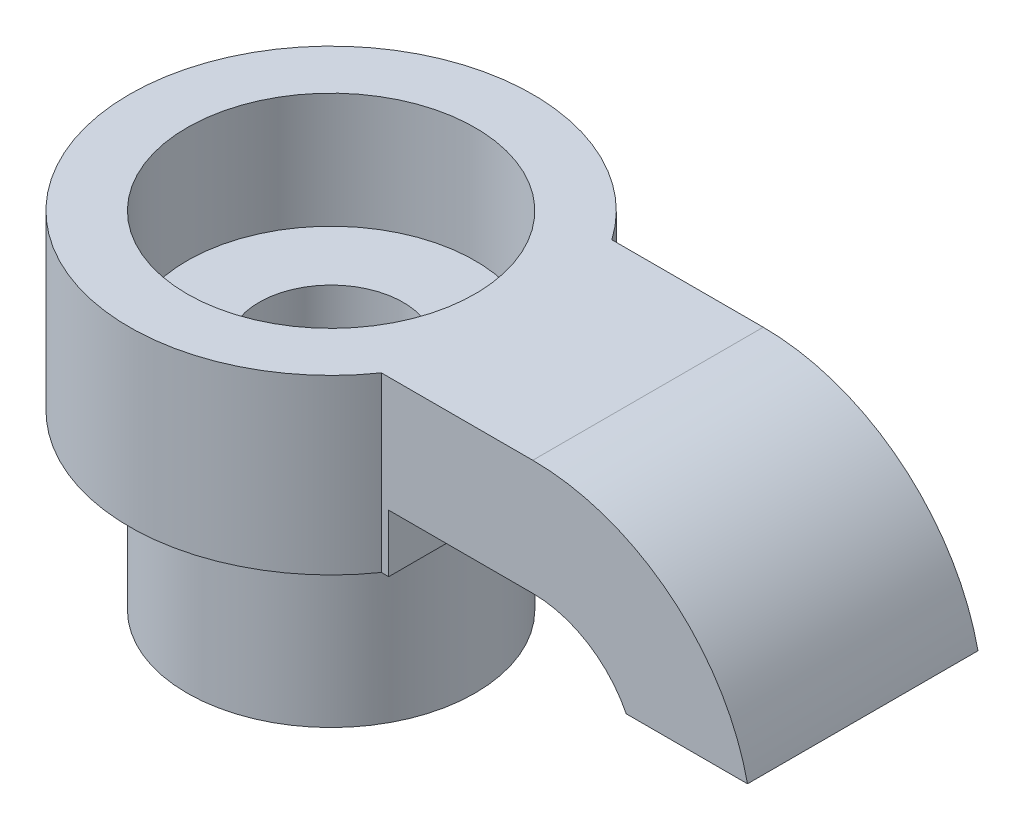
ISO-10303-21;
HEADER;
FILE_DESCRIPTION(('STEP AP214'),'2;1');
FILE_NAME('part.step','',(''),(''),'','','');
FILE_SCHEMA(('AUTOMOTIVE_DESIGN { 1 0 10303 214 1 1 1 1 }'));
ENDSEC;
DATA;
#1=APPLICATION_CONTEXT('core data for automotive mechanical design processes');
#2=APPLICATION_PROTOCOL_DEFINITION('international standard','automotive_design',2000,#1);
#3=PRODUCT_CONTEXT('',#1,'mechanical');
#4=PRODUCT('Part','Part','',(#3));
#5=PRODUCT_RELATED_PRODUCT_CATEGORY('part','',(#4));
#6=PRODUCT_DEFINITION_FORMATION('','',#4);
#7=PRODUCT_DEFINITION_CONTEXT('part definition',#1,'design');
#8=PRODUCT_DEFINITION('design','',#6,#7);
#9=PRODUCT_DEFINITION_SHAPE('','',#8);
#10=(LENGTH_UNIT() NAMED_UNIT(*) SI_UNIT(.MILLI.,.METRE.));
#11=(NAMED_UNIT(*) PLANE_ANGLE_UNIT() SI_UNIT($,.RADIAN.));
#12=(NAMED_UNIT(*) SI_UNIT($,.STERADIAN.) SOLID_ANGLE_UNIT());
#13=UNCERTAINTY_MEASURE_WITH_UNIT(LENGTH_MEASURE(1.E-05),#10,'distance_accuracy_value','');
#14=(GEOMETRIC_REPRESENTATION_CONTEXT(3) GLOBAL_UNCERTAINTY_ASSIGNED_CONTEXT((#13)) GLOBAL_UNIT_ASSIGNED_CONTEXT((#10,
#11,#12)) REPRESENTATION_CONTEXT('',''));
#15=CARTESIAN_POINT('',(0.,0.,0.));
#16=DIRECTION('',(0.,0.,1.));
#17=DIRECTION('',(1.,0.,0.));
#18=AXIS2_PLACEMENT_3D('',#15,#16,#17);
#19=CARTESIAN_POINT('',(-6.,-6.,4.));
#20=DIRECTION('',(0.,1.,0.));
#21=DIRECTION('',(0.,0.,1.));
#22=AXIS2_PLACEMENT_3D('',#19,#20,#21);
#23=PLANE('',#22);
#24=CARTESIAN_POINT('',(-6.,-6.,4.));
#25=DIRECTION('',(0.,1.,0.));
#26=DIRECTION('',(0.,0.,1.));
#27=AXIS2_PLACEMENT_3D('',#24,#25,#26);
#28=CIRCLE('',#27,7.);
#29=CARTESIAN_POINT('',(-0.255437353461972,-6.,0.));
#30=VERTEX_POINT('',#29);
#31=CARTESIAN_POINT('',(-0.255437353461972,-6.,8.));
#32=VERTEX_POINT('',#31);
#33=EDGE_CURVE('E129',#30,#32,#28,.T.);
#34=ORIENTED_EDGE('',*,*,#33,.F.);
#35=DIRECTION('',(-1.,0.,0.));
#36=VECTOR('',#35,1.);
#37=CARTESIAN_POINT('',(-0.255437353461972,-6.,0.));
#38=LINE('',#37,#36);
#39=CARTESIAN_POINT('',(0.,-6.,0.));
#40=VERTEX_POINT('',#39);
#41=EDGE_CURVE('E122',#40,#30,#38,.T.);
#42=ORIENTED_EDGE('',*,*,#41,.F.);
#43=DIRECTION('',(0.,0.,-1.));
#44=VECTOR('',#43,1.);
#45=CARTESIAN_POINT('',(0.,-6.,0.));
#46=LINE('',#45,#44);
#47=CARTESIAN_POINT('',(0.,-6.,8.));
#48=VERTEX_POINT('',#47);
#49=EDGE_CURVE('E132',#48,#40,#46,.T.);
#50=ORIENTED_EDGE('',*,*,#49,.F.);
#51=DIRECTION('',(1.,0.,0.));
#52=VECTOR('',#51,1.);
#53=CARTESIAN_POINT('',(0.,-6.,8.));
#54=LINE('',#53,#52);
#55=EDGE_CURVE('E114',#32,#48,#54,.T.);
#56=ORIENTED_EDGE('',*,*,#55,.F.);
#57=EDGE_LOOP('',(#34,#42,#50,#56));
#58=FACE_BOUND('',#57,.T.);
#59=CARTESIAN_POINT('',(-6.,-6.,4.));
#60=DIRECTION('',(0.,1.,0.));
#61=DIRECTION('',(0.,0.,1.));
#62=AXIS2_PLACEMENT_3D('',#59,#60,#61);
#63=CIRCLE('',#62,5.);
#64=CARTESIAN_POINT('',(-6.,-6.,9.));
#65=VERTEX_POINT('',#64);
#66=EDGE_CURVE('E11',#65,#65,#63,.F.);
#67=ORIENTED_EDGE('',*,*,#66,.F.);
#68=EDGE_LOOP('',(#67));
#69=FACE_BOUND('',#68,.T.);
#70=ADVANCED_FACE('F36',(#58,#69),#23,.F.);
#71=CARTESIAN_POINT('',(0.,-4.,8.));
#72=DIRECTION('',(0.,1.,0.));
#73=DIRECTION('',(0.,0.,1.));
#74=AXIS2_PLACEMENT_3D('',#71,#72,#73);
#75=PLANE('',#74);
#76=DIRECTION('',(1.,0.,0.));
#77=VECTOR('',#76,1.);
#78=CARTESIAN_POINT('',(0.,-4.,0.));
#79=LINE('',#78,#77);
#80=CARTESIAN_POINT('',(0.,-4.,0.));
#81=VERTEX_POINT('',#80);
#82=CARTESIAN_POINT('',(5.,-4.,0.));
#83=VERTEX_POINT('',#82);
#84=EDGE_CURVE('E147',#81,#83,#79,.T.);
#85=ORIENTED_EDGE('',*,*,#84,.T.);
#86=DIRECTION('',(0.,0.,-1.));
#87=VECTOR('',#86,1.);
#88=CARTESIAN_POINT('',(5.,-4.,8.));
#89=LINE('',#88,#87);
#90=CARTESIAN_POINT('',(5.,-4.,8.));
#91=VERTEX_POINT('',#90);
#92=EDGE_CURVE('E173',#91,#83,#89,.T.);
#93=ORIENTED_EDGE('',*,*,#92,.F.);
#94=DIRECTION('',(1.,0.,0.));
#95=VECTOR('',#94,1.);
#96=CARTESIAN_POINT('',(0.,-4.,8.));
#97=LINE('',#96,#95);
#98=CARTESIAN_POINT('',(0.,-4.,8.));
#99=VERTEX_POINT('',#98);
#100=EDGE_CURVE('E88',#99,#91,#97,.T.);
#101=ORIENTED_EDGE('',*,*,#100,.F.);
#102=DIRECTION('',(0.,0.,-1.));
#103=VECTOR('',#102,1.);
#104=CARTESIAN_POINT('',(0.,-4.,8.));
#105=LINE('',#104,#103);
#106=EDGE_CURVE('E46',#99,#81,#105,.T.);
#107=ORIENTED_EDGE('',*,*,#106,.T.);
#108=EDGE_LOOP('',(#85,#93,#101,#107));
#109=FACE_BOUND('',#108,.T.);
#110=ADVANCED_FACE('F38',(#109),#75,.F.);
#111=CARTESIAN_POINT('',(5.,-7.63014946104609,8.));
#112=DIRECTION('',(0.,0.,-1.));
#113=DIRECTION('',(-1.,0.,0.));
#114=AXIS2_PLACEMENT_3D('',#111,#112,#113);
#115=CYLINDRICAL_SURFACE('',#114,3.63014946104609);
#116=CARTESIAN_POINT('',(5.,-7.63014946104609,0.));
#117=DIRECTION('',(0.,0.,-1.));
#118=DIRECTION('',(-1.,0.,0.));
#119=AXIS2_PLACEMENT_3D('',#116,#117,#118);
#120=CIRCLE('',#119,3.63014946104609);
#121=CARTESIAN_POINT('',(8.24354710836522,-6.,0.));
#122=VERTEX_POINT('',#121);
#123=EDGE_CURVE('E162',#83,#122,#120,.T.);
#124=ORIENTED_EDGE('',*,*,#123,.T.);
#125=DIRECTION('',(0.,0.,-1.));
#126=VECTOR('',#125,1.);
#127=CARTESIAN_POINT('',(8.24354710836522,-6.,8.));
#128=LINE('',#127,#126);
#129=CARTESIAN_POINT('',(8.24354710836522,-6.,8.));
#130=VERTEX_POINT('',#129);
#131=EDGE_CURVE('E171',#130,#122,#128,.T.);
#132=ORIENTED_EDGE('',*,*,#131,.F.);
#133=CARTESIAN_POINT('',(5.,-7.63014946104609,8.));
#134=DIRECTION('',(0.,0.,-1.));
#135=DIRECTION('',(-1.,0.,0.));
#136=AXIS2_PLACEMENT_3D('',#133,#134,#135);
#137=CIRCLE('',#136,3.63014946104609);
#138=EDGE_CURVE('E155',#91,#130,#137,.T.);
#139=ORIENTED_EDGE('',*,*,#138,.F.);
#140=ORIENTED_EDGE('',*,*,#92,.T.);
#141=EDGE_LOOP('',(#124,#132,#139,#140));
#142=FACE_BOUND('',#141,.T.);
#143=ADVANCED_FACE('F194',(#142),#115,.F.);
#144=CARTESIAN_POINT('',(8.24354710836522,-6.,8.));
#145=DIRECTION('',(0.,1.,0.));
#146=DIRECTION('',(0.,0.,1.));
#147=AXIS2_PLACEMENT_3D('',#144,#145,#146);
#148=PLANE('',#147);
#149=DIRECTION('',(1.,0.,0.));
#150=VECTOR('',#149,1.);
#151=CARTESIAN_POINT('',(8.24354710836522,-6.,0.));
#152=LINE('',#151,#150);
#153=CARTESIAN_POINT('',(12.4539783694718,-6.,0.));
#154=VERTEX_POINT('',#153);
#155=EDGE_CURVE('E75',#122,#154,#152,.T.);
#156=ORIENTED_EDGE('',*,*,#155,.T.);
#157=DIRECTION('',(0.,0.,-1.));
#158=VECTOR('',#157,1.);
#159=CARTESIAN_POINT('',(12.4539783694718,-6.,8.));
#160=LINE('',#159,#158);
#161=CARTESIAN_POINT('',(12.4539783694718,-6.,8.));
#162=VERTEX_POINT('',#161);
#163=EDGE_CURVE('E169',#162,#154,#160,.T.);
#164=ORIENTED_EDGE('',*,*,#163,.F.);
#165=DIRECTION('',(1.,0.,0.));
#166=VECTOR('',#165,1.);
#167=CARTESIAN_POINT('',(8.24354710836522,-6.,8.));
#168=LINE('',#167,#166);
#169=EDGE_CURVE('E157',#130,#162,#168,.T.);
#170=ORIENTED_EDGE('',*,*,#169,.F.);
#171=ORIENTED_EDGE('',*,*,#131,.T.);
#172=EDGE_LOOP('',(#156,#164,#170,#171));
#173=FACE_BOUND('',#172,.T.);
#174=ADVANCED_FACE('F197',(#173),#148,.F.);
#175=CARTESIAN_POINT('',(5.,-7.63014946104609,8.));
#176=DIRECTION('',(0.,0.,-1.));
#177=DIRECTION('',(-1.,0.,0.));
#178=AXIS2_PLACEMENT_3D('',#175,#176,#177);
#179=CYLINDRICAL_SURFACE('',#178,7.63014946104609);
#180=CARTESIAN_POINT('',(5.,-7.63014946104609,0.));
#181=DIRECTION('',(0.,0.,1.));
#182=DIRECTION('',(-1.,0.,0.));
#183=AXIS2_PLACEMENT_3D('',#180,#181,#182);
#184=CIRCLE('',#183,7.63014946104609);
#185=CARTESIAN_POINT('',(5.,0.,0.));
#186=VERTEX_POINT('',#185);
#187=EDGE_CURVE('E81',#154,#186,#184,.T.);
#188=ORIENTED_EDGE('',*,*,#187,.T.);
#189=DIRECTION('',(0.,0.,-1.));
#190=VECTOR('',#189,1.);
#191=CARTESIAN_POINT('',(5.,0.,8.));
#192=LINE('',#191,#190);
#193=CARTESIAN_POINT('',(5.,0.,8.));
#194=VERTEX_POINT('',#193);
#195=EDGE_CURVE('E161',#194,#186,#192,.T.);
#196=ORIENTED_EDGE('',*,*,#195,.F.);
#197=CARTESIAN_POINT('',(5.,-7.63014946104609,8.));
#198=DIRECTION('',(0.,0.,1.));
#199=DIRECTION('',(-1.,0.,0.));
#200=AXIS2_PLACEMENT_3D('',#197,#198,#199);
#201=CIRCLE('',#200,7.63014946104609);
#202=EDGE_CURVE('E54',#162,#194,#201,.T.);
#203=ORIENTED_EDGE('',*,*,#202,.F.);
#204=ORIENTED_EDGE('',*,*,#163,.T.);
#205=EDGE_LOOP('',(#188,#196,#203,#204));
#206=FACE_BOUND('',#205,.T.);
#207=ADVANCED_FACE('F198',(#206),#179,.T.);
#208=CARTESIAN_POINT('',(0.,0.,8.));
#209=DIRECTION('',(0.,-1.,0.));
#210=DIRECTION('',(0.,0.,-1.));
#211=AXIS2_PLACEMENT_3D('',#208,#209,#210);
#212=PLANE('',#211);
#213=CARTESIAN_POINT('',(-6.,0.,4.));
#214=DIRECTION('',(0.,1.,0.));
#215=DIRECTION('',(0.,0.,1.));
#216=AXIS2_PLACEMENT_3D('',#213,#214,#215);
#217=CIRCLE('',#216,5.00000000000002);
#218=CARTESIAN_POINT('',(-6.,0.,9.00000000000001));
#219=VERTEX_POINT('',#218);
#220=EDGE_CURVE('E348',#219,#219,#217,.T.);
#221=ORIENTED_EDGE('',*,*,#220,.F.);
#222=EDGE_LOOP('',(#221));
#223=FACE_BOUND('',#222,.T.);
#224=DIRECTION('',(-1.,0.,0.));
#225=VECTOR('',#224,1.);
#226=CARTESIAN_POINT('',(0.,0.,0.));
#227=LINE('',#226,#225);
#228=CARTESIAN_POINT('',(-0.255437353461972,0.,0.));
#229=VERTEX_POINT('',#228);
#230=EDGE_CURVE('E166',#186,#229,#227,.T.);
#231=ORIENTED_EDGE('',*,*,#230,.T.);
#232=CARTESIAN_POINT('',(-6.,0.,4.));
#233=DIRECTION('',(0.,1.,0.));
#234=DIRECTION('',(0.,0.,1.));
#235=AXIS2_PLACEMENT_3D('',#232,#233,#234);
#236=CIRCLE('',#235,7.);
#237=CARTESIAN_POINT('',(-0.255437353461972,0.,8.));
#238=VERTEX_POINT('',#237);
#239=EDGE_CURVE('E137',#229,#238,#236,.T.);
#240=ORIENTED_EDGE('',*,*,#239,.T.);
#241=DIRECTION('',(-1.,0.,0.));
#242=VECTOR('',#241,1.);
#243=CARTESIAN_POINT('',(0.,0.,8.));
#244=LINE('',#243,#242);
#245=EDGE_CURVE('E116',#194,#238,#244,.T.);
#246=ORIENTED_EDGE('',*,*,#245,.F.);
#247=ORIENTED_EDGE('',*,*,#195,.T.);
#248=EDGE_LOOP('',(#231,#240,#246,#247));
#249=FACE_BOUND('',#248,.T.);
#250=ADVANCED_FACE('F201',(#223,#249),#212,.F.);
#251=CARTESIAN_POINT('',(5.,-7.63014946104609,8.));
#252=DIRECTION('',(0.,0.,-1.));
#253=DIRECTION('',(-1.,0.,0.));
#254=AXIS2_PLACEMENT_3D('',#251,#252,#253);
#255=PLANE('',#254);
#256=ORIENTED_EDGE('',*,*,#245,.T.);
#257=DIRECTION('',(0.,1.,0.));
#258=VECTOR('',#257,1.);
#259=CARTESIAN_POINT('',(-0.255437353461972,-6.,8.));
#260=LINE('',#259,#258);
#261=EDGE_CURVE('E111',#32,#238,#260,.T.);
#262=ORIENTED_EDGE('',*,*,#261,.F.);
#263=ORIENTED_EDGE('',*,*,#55,.T.);
#264=DIRECTION('',(0.,1.,0.));
#265=VECTOR('',#264,1.);
#266=CARTESIAN_POINT('',(0.,-6.,8.));
#267=LINE('',#266,#265);
#268=EDGE_CURVE('E121',#48,#99,#267,.T.);
#269=ORIENTED_EDGE('',*,*,#268,.T.);
#270=ORIENTED_EDGE('',*,*,#100,.T.);
#271=ORIENTED_EDGE('',*,*,#138,.T.);
#272=ORIENTED_EDGE('',*,*,#169,.T.);
#273=ORIENTED_EDGE('',*,*,#202,.T.);
#274=EDGE_LOOP('',(#256,#262,#263,#269,#270,#271,#272,#273));
#275=FACE_BOUND('',#274,.T.);
#276=ADVANCED_FACE('F113',(#275),#255,.F.);
#277=CARTESIAN_POINT('',(5.,-7.63014946104609,0.));
#278=DIRECTION('',(0.,0.,-1.));
#279=DIRECTION('',(-1.,0.,0.));
#280=AXIS2_PLACEMENT_3D('',#277,#278,#279);
#281=PLANE('',#280);
#282=ORIENTED_EDGE('',*,*,#84,.F.);
#283=DIRECTION('',(0.,1.,0.));
#284=VECTOR('',#283,1.);
#285=CARTESIAN_POINT('',(0.,-6.,0.));
#286=LINE('',#285,#284);
#287=EDGE_CURVE('E148',#40,#81,#286,.T.);
#288=ORIENTED_EDGE('',*,*,#287,.F.);
#289=ORIENTED_EDGE('',*,*,#41,.T.);
#290=DIRECTION('',(0.,1.,0.));
#291=VECTOR('',#290,1.);
#292=CARTESIAN_POINT('',(-0.255437353461972,-6.,0.));
#293=LINE('',#292,#291);
#294=EDGE_CURVE('E136',#30,#229,#293,.T.);
#295=ORIENTED_EDGE('',*,*,#294,.T.);
#296=ORIENTED_EDGE('',*,*,#230,.F.);
#297=ORIENTED_EDGE('',*,*,#187,.F.);
#298=ORIENTED_EDGE('',*,*,#155,.F.);
#299=ORIENTED_EDGE('',*,*,#123,.F.);
#300=EDGE_LOOP('',(#282,#288,#289,#295,#296,#297,#298,#299));
#301=FACE_BOUND('',#300,.T.);
#302=ADVANCED_FACE('F191',(#301),#281,.T.);
#303=CARTESIAN_POINT('',(0.,-6.,0.));
#304=DIRECTION('',(1.,0.,0.));
#305=DIRECTION('',(0.,0.,-1.));
#306=AXIS2_PLACEMENT_3D('',#303,#304,#305);
#307=PLANE('',#306);
#308=ORIENTED_EDGE('',*,*,#106,.F.);
#309=ORIENTED_EDGE('',*,*,#268,.F.);
#310=ORIENTED_EDGE('',*,*,#49,.T.);
#311=ORIENTED_EDGE('',*,*,#287,.T.);
#312=EDGE_LOOP('',(#308,#309,#310,#311));
#313=FACE_BOUND('',#312,.T.);
#314=ADVANCED_FACE('F188',(#313),#307,.T.);
#315=CARTESIAN_POINT('',(-6.,-6.,4.));
#316=DIRECTION('',(0.,1.,0.));
#317=DIRECTION('',(0.,0.,1.));
#318=AXIS2_PLACEMENT_3D('',#315,#316,#317);
#319=CYLINDRICAL_SURFACE('',#318,7.);
#320=ORIENTED_EDGE('',*,*,#239,.F.);
#321=ORIENTED_EDGE('',*,*,#294,.F.);
#322=ORIENTED_EDGE('',*,*,#33,.T.);
#323=ORIENTED_EDGE('',*,*,#261,.T.);
#324=EDGE_LOOP('',(#320,#321,#322,#323));
#325=FACE_BOUND('',#324,.T.);
#326=ADVANCED_FACE('F134',(#325),#319,.T.);
#327=CARTESIAN_POINT('',(-6.,-12.,4.));
#328=DIRECTION('',(0.,1.,0.));
#329=DIRECTION('',(0.,0.,1.));
#330=AXIS2_PLACEMENT_3D('',#327,#328,#329);
#331=CYLINDRICAL_SURFACE('',#330,5.);
#332=CARTESIAN_POINT('',(-6.,-12.,4.));
#333=DIRECTION('',(0.,-1.,0.));
#334=DIRECTION('',(0.,0.,-1.));
#335=AXIS2_PLACEMENT_3D('',#332,#333,#334);
#336=CIRCLE('',#335,5.);
#337=CARTESIAN_POINT('',(-6.,-12.,-1.));
#338=VERTEX_POINT('',#337);
#339=EDGE_CURVE('E139',#338,#338,#336,.T.);
#340=ORIENTED_EDGE('',*,*,#339,.F.);
#341=EDGE_LOOP('',(#340));
#342=FACE_BOUND('',#341,.T.);
#343=ORIENTED_EDGE('',*,*,#66,.T.);
#344=EDGE_LOOP('',(#343));
#345=FACE_BOUND('',#344,.T.);
#346=ADVANCED_FACE('F220',(#342,#345),#331,.T.);
#347=CARTESIAN_POINT('',(-6.,-12.,4.));
#348=DIRECTION('',(0.,-1.,0.));
#349=DIRECTION('',(0.,0.,-1.));
#350=AXIS2_PLACEMENT_3D('',#347,#348,#349);
#351=PLANE('',#350);
#352=CARTESIAN_POINT('',(-6.,-12.,4.));
#353=DIRECTION('',(0.,-1.,0.));
#354=DIRECTION('',(0.,0.,-1.));
#355=AXIS2_PLACEMENT_3D('',#352,#353,#354);
#356=CIRCLE('',#355,2.50000000000001);
#357=CARTESIAN_POINT('',(-6.,-12.,1.49999999999999));
#358=VERTEX_POINT('',#357);
#359=EDGE_CURVE('E40',#358,#358,#356,.T.);
#360=ORIENTED_EDGE('',*,*,#359,.F.);
#361=EDGE_LOOP('',(#360));
#362=FACE_BOUND('',#361,.T.);
#363=ORIENTED_EDGE('',*,*,#339,.T.);
#364=EDGE_LOOP('',(#363));
#365=FACE_BOUND('',#364,.T.);
#366=ADVANCED_FACE('F244',(#362,#365),#351,.T.);
#367=CARTESIAN_POINT('',(-6.,0.,4.));
#368=DIRECTION('',(0.,1.,0.));
#369=DIRECTION('',(0.,0.,1.));
#370=AXIS2_PLACEMENT_3D('',#367,#368,#369);
#371=CYLINDRICAL_SURFACE('',#370,2.50000000000001);
#372=ORIENTED_EDGE('',*,*,#359,.T.);
#373=EDGE_LOOP('',(#372));
#374=FACE_BOUND('',#373,.T.);
#375=CARTESIAN_POINT('',(-6.,-4.,4.));
#376=DIRECTION('',(0.,1.,0.));
#377=DIRECTION('',(0.,0.,1.));
#378=AXIS2_PLACEMENT_3D('',#375,#376,#377);
#379=CIRCLE('',#378,2.50000000000001);
#380=CARTESIAN_POINT('',(-6.,-4.,6.50000000000001));
#381=VERTEX_POINT('',#380);
#382=EDGE_CURVE('E350',#381,#381,#379,.T.);
#383=ORIENTED_EDGE('',*,*,#382,.T.);
#384=EDGE_LOOP('',(#383));
#385=FACE_BOUND('',#384,.T.);
#386=ADVANCED_FACE('F251',(#374,#385),#371,.F.);
#387=CARTESIAN_POINT('',(-3.49999999999999,-4.,4.));
#388=DIRECTION('',(0.,-1.,0.));
#389=DIRECTION('',(0.,0.,-1.));
#390=AXIS2_PLACEMENT_3D('',#387,#388,#389);
#391=PLANE('',#390);
#392=ORIENTED_EDGE('',*,*,#382,.F.);
#393=EDGE_LOOP('',(#392));
#394=FACE_BOUND('',#393,.T.);
#395=CARTESIAN_POINT('',(-6.,-4.,4.));
#396=DIRECTION('',(0.,1.,0.));
#397=DIRECTION('',(0.,0.,1.));
#398=AXIS2_PLACEMENT_3D('',#395,#396,#397);
#399=CIRCLE('',#398,5.00000000000001);
#400=CARTESIAN_POINT('',(-6.,-4.,9.00000000000001));
#401=VERTEX_POINT('',#400);
#402=EDGE_CURVE('E346',#401,#401,#399,.T.);
#403=ORIENTED_EDGE('',*,*,#402,.T.);
#404=EDGE_LOOP('',(#403));
#405=FACE_BOUND('',#404,.T.);
#406=ADVANCED_FACE('F259',(#394,#405),#391,.F.);
#407=CARTESIAN_POINT('',(-6.,0.,4.));
#408=DIRECTION('',(0.,1.,0.));
#409=DIRECTION('',(0.,0.,1.));
#410=AXIS2_PLACEMENT_3D('',#407,#408,#409);
#411=CYLINDRICAL_SURFACE('',#410,5.00000000000001);
#412=ORIENTED_EDGE('',*,*,#402,.F.);
#413=EDGE_LOOP('',(#412));
#414=FACE_BOUND('',#413,.T.);
#415=ORIENTED_EDGE('',*,*,#220,.T.);
#416=EDGE_LOOP('',(#415));
#417=FACE_BOUND('',#416,.T.);
#418=ADVANCED_FACE('F266',(#414,#417),#411,.F.);
#419=CLOSED_SHELL('',(#70,#110,#143,#174,#207,#250,#276,#302,#314,#326,#346,#366,#386,#406,#418));
#420=MANIFOLD_SOLID_BREP('B2',#419);
#421=ADVANCED_BREP_SHAPE_REPRESENTATION('',(#18,#420),#14);
#422=SHAPE_DEFINITION_REPRESENTATION(#9,#421);
ENDSEC;
END-ISO-10303-21;
